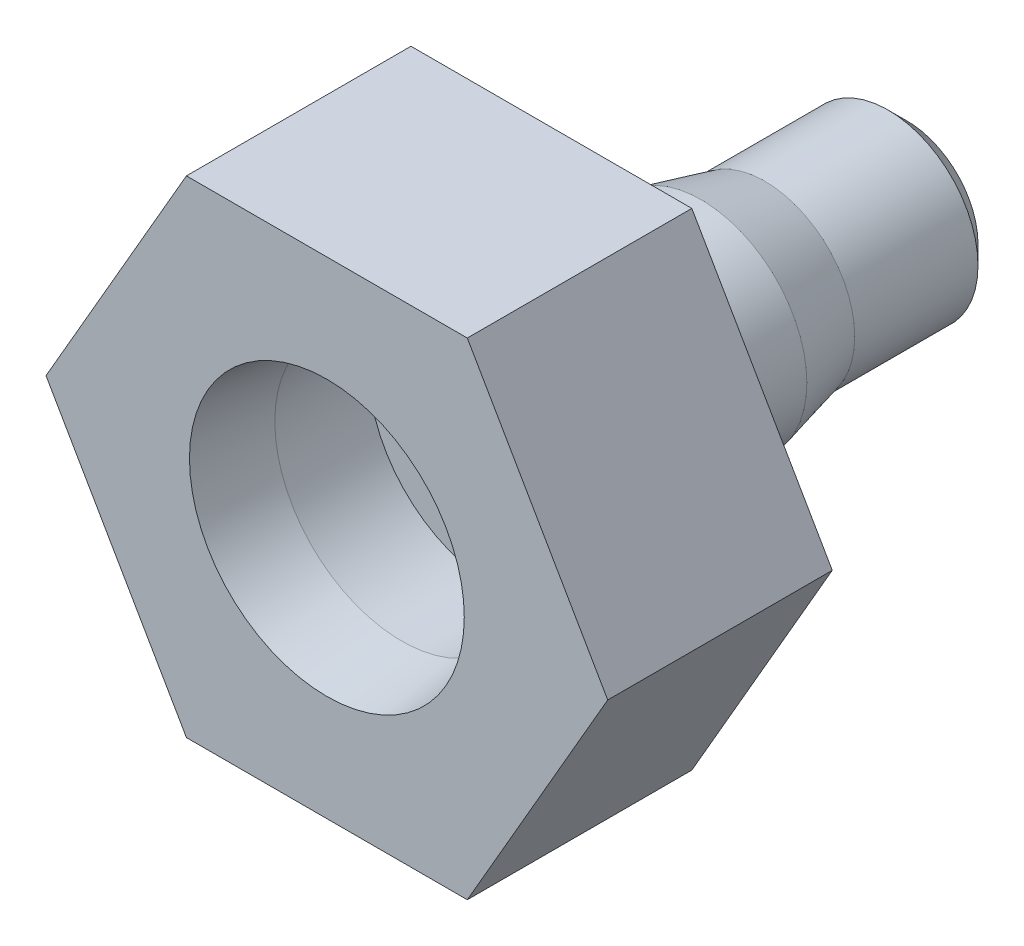
ISO-10303-21;
HEADER;
FILE_DESCRIPTION(('STEP AP214'),'2;1');
FILE_NAME('part.step','',(''),(''),'','','');
FILE_SCHEMA(('AUTOMOTIVE_DESIGN { 1 0 10303 214 1 1 1 1 }'));
ENDSEC;
DATA;
#1=APPLICATION_CONTEXT('core data for automotive mechanical design processes');
#2=APPLICATION_PROTOCOL_DEFINITION('international standard','automotive_design',2000,#1);
#3=PRODUCT_CONTEXT('',#1,'mechanical');
#4=PRODUCT('Part','Part','',(#3));
#5=PRODUCT_RELATED_PRODUCT_CATEGORY('part','',(#4));
#6=PRODUCT_DEFINITION_FORMATION('','',#4);
#7=PRODUCT_DEFINITION_CONTEXT('part definition',#1,'design');
#8=PRODUCT_DEFINITION('design','',#6,#7);
#9=PRODUCT_DEFINITION_SHAPE('','',#8);
#10=(LENGTH_UNIT() NAMED_UNIT(*) SI_UNIT(.MILLI.,.METRE.));
#11=(NAMED_UNIT(*) PLANE_ANGLE_UNIT() SI_UNIT($,.RADIAN.));
#12=(NAMED_UNIT(*) SI_UNIT($,.STERADIAN.) SOLID_ANGLE_UNIT());
#13=UNCERTAINTY_MEASURE_WITH_UNIT(LENGTH_MEASURE(1.E-05),#10,'distance_accuracy_value','');
#14=(GEOMETRIC_REPRESENTATION_CONTEXT(3) GLOBAL_UNCERTAINTY_ASSIGNED_CONTEXT((#13)) GLOBAL_UNIT_ASSIGNED_CONTEXT((#10,
#11,#12)) REPRESENTATION_CONTEXT('',''));
#15=CARTESIAN_POINT('',(0.,0.,0.));
#16=DIRECTION('',(0.,0.,1.));
#17=DIRECTION('',(1.,0.,0.));
#18=AXIS2_PLACEMENT_3D('',#15,#16,#17);
#19=CARTESIAN_POINT('',(0.,0.,-2.40416305603426));
#20=DIRECTION('',(0.,0.,1.));
#21=DIRECTION('',(1.,0.,0.));
#22=AXIS2_PLACEMENT_3D('',#19,#20,#21);
#23=CYLINDRICAL_SURFACE('',#22,0.85);
#24=CARTESIAN_POINT('',(0.,0.,0.));
#25=DIRECTION('',(0.,0.,1.));
#26=DIRECTION('',(1.,0.,0.));
#27=AXIS2_PLACEMENT_3D('',#24,#25,#26);
#28=CIRCLE('',#27,0.85);
#29=CARTESIAN_POINT('',(0.85,0.,0.));
#30=VERTEX_POINT('',#29);
#31=EDGE_CURVE('E146',#30,#30,#28,.F.);
#32=ORIENTED_EDGE('',*,*,#31,.T.);
#33=EDGE_LOOP('',(#32));
#34=FACE_BOUND('',#33,.T.);
#35=CARTESIAN_POINT('',(0.,0.,11.));
#36=DIRECTION('',(0.,0.,1.));
#37=DIRECTION('',(1.,0.,0.));
#38=AXIS2_PLACEMENT_3D('',#35,#36,#37);
#39=CIRCLE('',#38,0.85);
#40=CARTESIAN_POINT('',(0.85,0.,11.));
#41=VERTEX_POINT('',#40);
#42=EDGE_CURVE('E116',#41,#41,#39,.F.);
#43=ORIENTED_EDGE('',*,*,#42,.F.);
#44=EDGE_LOOP('',(#43));
#45=FACE_BOUND('',#44,.T.);
#46=ADVANCED_FACE('F44',(#34,#45),#23,.F.);
#47=CARTESIAN_POINT('',(0.,0.,0.));
#48=DIRECTION('',(0.,0.,1.));
#49=DIRECTION('',(1.,0.,0.));
#50=AXIS2_PLACEMENT_3D('',#47,#48,#49);
#51=PLANE('',#50);
#52=CARTESIAN_POINT('',(0.,0.,0.));
#53=DIRECTION('',(0.,0.,1.));
#54=DIRECTION('',(1.,0.,0.));
#55=AXIS2_PLACEMENT_3D('',#52,#53,#54);
#56=CIRCLE('',#55,1.9);
#57=CARTESIAN_POINT('',(1.9,0.,0.));
#58=VERTEX_POINT('',#57);
#59=EDGE_CURVE('E161',#58,#58,#56,.F.);
#60=ORIENTED_EDGE('',*,*,#59,.T.);
#61=EDGE_LOOP('',(#60));
#62=FACE_BOUND('',#61,.T.);
#63=ORIENTED_EDGE('',*,*,#31,.F.);
#64=EDGE_LOOP('',(#63));
#65=FACE_BOUND('',#64,.T.);
#66=ADVANCED_FACE('F184',(#62,#65),#51,.F.);
#67=CARTESIAN_POINT('',(0.,0.,9.5));
#68=DIRECTION('',(0.,0.,-1.));
#69=DIRECTION('',(-1.,0.,0.));
#70=AXIS2_PLACEMENT_3D('',#67,#68,#69);
#71=CYLINDRICAL_SURFACE('',#70,2.825);
#72=CARTESIAN_POINT('',(0.,0.,5.49865238330795));
#73=DIRECTION('',(0.,0.,1.));
#74=DIRECTION('',(1.,0.,0.));
#75=AXIS2_PLACEMENT_3D('',#72,#73,#74);
#76=CIRCLE('',#75,2.825);
#77=CARTESIAN_POINT('',(2.825,0.,5.49865238330795));
#78=VERTEX_POINT('',#77);
#79=EDGE_CURVE('E158',#78,#78,#76,.T.);
#80=ORIENTED_EDGE('',*,*,#79,.T.);
#81=EDGE_LOOP('',(#80));
#82=FACE_BOUND('',#81,.T.);
#83=CARTESIAN_POINT('',(0.,0.,8.50000000000001));
#84=DIRECTION('',(0.,0.,1.));
#85=DIRECTION('',(1.,0.,0.));
#86=AXIS2_PLACEMENT_3D('',#83,#84,#85);
#87=CIRCLE('',#86,2.825);
#88=CARTESIAN_POINT('',(2.825,0.,8.50000000000001));
#89=VERTEX_POINT('',#88);
#90=EDGE_CURVE('E152',#89,#89,#87,.F.);
#91=ORIENTED_EDGE('',*,*,#90,.T.);
#92=EDGE_LOOP('',(#91));
#93=FACE_BOUND('',#92,.T.);
#94=ADVANCED_FACE('F192',(#82,#93),#71,.T.);
#95=CARTESIAN_POINT('',(0.,0.,9.5));
#96=DIRECTION('',(0.,0.,1.));
#97=DIRECTION('',(1.,0.,0.));
#98=AXIS2_PLACEMENT_3D('',#95,#96,#97);
#99=PLANE('',#98);
#100=CARTESIAN_POINT('',(0.,0.,9.5));
#101=DIRECTION('',(0.,0.,1.));
#102=DIRECTION('',(1.,0.,0.));
#103=AXIS2_PLACEMENT_3D('',#100,#101,#102);
#104=CIRCLE('',#103,3.82500000000001);
#105=CARTESIAN_POINT('',(3.82500000000001,0.,9.5));
#106=VERTEX_POINT('',#105);
#107=EDGE_CURVE('E149',#106,#106,#104,.T.);
#108=ORIENTED_EDGE('',*,*,#107,.T.);
#109=EDGE_LOOP('',(#108));
#110=FACE_BOUND('',#109,.T.);
#111=DIRECTION('',(0.5,0.866025403784439,0.));
#112=VECTOR('',#111,1.);
#113=CARTESIAN_POINT('',(-3.75277674973257,6.5,9.5));
#114=LINE('',#113,#112);
#115=CARTESIAN_POINT('',(-7.50555349946514,0.,9.5));
#116=VERTEX_POINT('',#115);
#117=CARTESIAN_POINT('',(-3.75277674973257,6.5,9.5));
#118=VERTEX_POINT('',#117);
#119=EDGE_CURVE('E78',#116,#118,#114,.T.);
#120=ORIENTED_EDGE('',*,*,#119,.T.);
#121=DIRECTION('',(1.,0.,0.));
#122=VECTOR('',#121,1.);
#123=CARTESIAN_POINT('',(3.75277674973257,6.5,9.5));
#124=LINE('',#123,#122);
#125=CARTESIAN_POINT('',(3.75277674973257,6.5,9.5));
#126=VERTEX_POINT('',#125);
#127=EDGE_CURVE('E83',#118,#126,#124,.T.);
#128=ORIENTED_EDGE('',*,*,#127,.T.);
#129=DIRECTION('',(0.5,-0.866025403784439,0.));
#130=VECTOR('',#129,1.);
#131=CARTESIAN_POINT('',(7.50555349946513,0.,9.5));
#132=LINE('',#131,#130);
#133=CARTESIAN_POINT('',(7.50555349946513,0.,9.5));
#134=VERTEX_POINT('',#133);
#135=EDGE_CURVE('E120',#126,#134,#132,.T.);
#136=ORIENTED_EDGE('',*,*,#135,.T.);
#137=DIRECTION('',(-0.5,-0.866025403784439,0.));
#138=VECTOR('',#137,1.);
#139=CARTESIAN_POINT('',(3.75277674973257,-6.5,9.5));
#140=LINE('',#139,#138);
#141=CARTESIAN_POINT('',(3.75277674973257,-6.5,9.5));
#142=VERTEX_POINT('',#141);
#143=EDGE_CURVE('E62',#134,#142,#140,.T.);
#144=ORIENTED_EDGE('',*,*,#143,.T.);
#145=DIRECTION('',(-1.,0.,0.));
#146=VECTOR('',#145,1.);
#147=CARTESIAN_POINT('',(-3.75277674973257,-6.5,9.5));
#148=LINE('',#147,#146);
#149=CARTESIAN_POINT('',(-3.75277674973257,-6.5,9.5));
#150=VERTEX_POINT('',#149);
#151=EDGE_CURVE('E376',#142,#150,#148,.T.);
#152=ORIENTED_EDGE('',*,*,#151,.T.);
#153=DIRECTION('',(-0.5,0.866025403784439,0.));
#154=VECTOR('',#153,1.);
#155=CARTESIAN_POINT('',(-7.50555349946514,0.,9.5));
#156=LINE('',#155,#154);
#157=EDGE_CURVE('E371',#150,#116,#156,.T.);
#158=ORIENTED_EDGE('',*,*,#157,.T.);
#159=EDGE_LOOP('',(#120,#128,#136,#144,#152,#158));
#160=FACE_BOUND('',#159,.T.);
#161=ADVANCED_FACE('F203',(#110,#160),#99,.F.);
#162=CARTESIAN_POINT('',(0.,0.,9.5));
#163=DIRECTION('',(0.,0.,1.));
#164=DIRECTION('',(1.,0.,0.));
#165=AXIS2_PLACEMENT_3D('',#162,#163,#164);
#166=CONICAL_SURFACE('',#165,3.82500000000001,0.785398163397455);
#167=ORIENTED_EDGE('',*,*,#90,.F.);
#168=EDGE_LOOP('',(#167));
#169=FACE_BOUND('',#168,.T.);
#170=ORIENTED_EDGE('',*,*,#107,.F.);
#171=EDGE_LOOP('',(#170));
#172=FACE_BOUND('',#171,.T.);
#173=ADVANCED_FACE('F201',(#169,#172),#166,.T.);
#174=CARTESIAN_POINT('',(0.,0.,15.5));
#175=DIRECTION('',(0.,0.,1.));
#176=DIRECTION('',(1.,0.,0.));
#177=AXIS2_PLACEMENT_3D('',#174,#175,#176);
#178=PLANE('',#177);
#179=CARTESIAN_POINT('',(0.,0.,15.5));
#180=DIRECTION('',(0.,0.,1.));
#181=DIRECTION('',(1.,0.,0.));
#182=AXIS2_PLACEMENT_3D('',#179,#180,#181);
#183=CIRCLE('',#182,3.67198166940478);
#184=CARTESIAN_POINT('',(3.67198166940478,0.,15.5));
#185=VERTEX_POINT('',#184);
#186=EDGE_CURVE('E13',#185,#185,#183,.F.);
#187=ORIENTED_EDGE('',*,*,#186,.T.);
#188=EDGE_LOOP('',(#187));
#189=FACE_BOUND('',#188,.T.);
#190=DIRECTION('',(0.5,0.866025403784439,0.));
#191=VECTOR('',#190,1.);
#192=CARTESIAN_POINT('',(3.75277674973257,-6.5,15.5));
#193=LINE('',#192,#191);
#194=CARTESIAN_POINT('',(3.75277674973257,-6.5,15.5));
#195=VERTEX_POINT('',#194);
#196=CARTESIAN_POINT('',(7.50555349946513,0.,15.5));
#197=VERTEX_POINT('',#196);
#198=EDGE_CURVE('E95',#195,#197,#193,.T.);
#199=ORIENTED_EDGE('',*,*,#198,.T.);
#200=DIRECTION('',(-0.5,0.866025403784438,0.));
#201=VECTOR('',#200,1.);
#202=CARTESIAN_POINT('',(7.50555349946513,0.,15.5));
#203=LINE('',#202,#201);
#204=CARTESIAN_POINT('',(3.75277674973257,6.5,15.5));
#205=VERTEX_POINT('',#204);
#206=EDGE_CURVE('E109',#197,#205,#203,.T.);
#207=ORIENTED_EDGE('',*,*,#206,.T.);
#208=DIRECTION('',(-1.,0.,0.));
#209=VECTOR('',#208,1.);
#210=CARTESIAN_POINT('',(3.75277674973257,6.5,15.5));
#211=LINE('',#210,#209);
#212=CARTESIAN_POINT('',(-3.75277674973257,6.5,15.5));
#213=VERTEX_POINT('',#212);
#214=EDGE_CURVE('E113',#205,#213,#211,.T.);
#215=ORIENTED_EDGE('',*,*,#214,.T.);
#216=DIRECTION('',(-0.499999999999999,-0.866025403784439,0.));
#217=VECTOR('',#216,1.);
#218=CARTESIAN_POINT('',(-3.75277674973257,6.5,15.5));
#219=LINE('',#218,#217);
#220=CARTESIAN_POINT('',(-7.50555349946514,0.,15.5));
#221=VERTEX_POINT('',#220);
#222=EDGE_CURVE('E125',#213,#221,#219,.T.);
#223=ORIENTED_EDGE('',*,*,#222,.T.);
#224=DIRECTION('',(0.5,-0.866025403784438,0.));
#225=VECTOR('',#224,1.);
#226=CARTESIAN_POINT('',(-7.50555349946514,0.,15.5));
#227=LINE('',#226,#225);
#228=CARTESIAN_POINT('',(-3.75277674973257,-6.5,15.5));
#229=VERTEX_POINT('',#228);
#230=EDGE_CURVE('E127',#221,#229,#227,.T.);
#231=ORIENTED_EDGE('',*,*,#230,.T.);
#232=DIRECTION('',(1.,0.,0.));
#233=VECTOR('',#232,1.);
#234=CARTESIAN_POINT('',(-3.75277674973257,-6.5,15.5));
#235=LINE('',#234,#233);
#236=EDGE_CURVE('E132',#229,#195,#235,.T.);
#237=ORIENTED_EDGE('',*,*,#236,.T.);
#238=EDGE_LOOP('',(#199,#207,#215,#223,#231,#237));
#239=FACE_BOUND('',#238,.T.);
#240=ADVANCED_FACE('F111',(#189,#239),#178,.T.);
#241=CARTESIAN_POINT('',(3.75277674973257,6.5,-10.3578280114753));
#242=DIRECTION('',(0.,1.,0.));
#243=DIRECTION('',(0.,0.,1.));
#244=AXIS2_PLACEMENT_3D('',#241,#242,#243);
#245=PLANE('',#244);
#246=ORIENTED_EDGE('',*,*,#127,.F.);
#247=DIRECTION('',(0.,0.,1.));
#248=VECTOR('',#247,1.);
#249=CARTESIAN_POINT('',(-3.75277674973257,6.5,-10.3578280114753));
#250=LINE('',#249,#248);
#251=EDGE_CURVE('E121',#118,#213,#250,.T.);
#252=ORIENTED_EDGE('',*,*,#251,.T.);
#253=ORIENTED_EDGE('',*,*,#214,.F.);
#254=DIRECTION('',(0.,0.,1.));
#255=VECTOR('',#254,1.);
#256=CARTESIAN_POINT('',(3.75277674973257,6.5,-10.3578280114753));
#257=LINE('',#256,#255);
#258=EDGE_CURVE('E118',#126,#205,#257,.T.);
#259=ORIENTED_EDGE('',*,*,#258,.F.);
#260=EDGE_LOOP('',(#246,#252,#253,#259));
#261=FACE_BOUND('',#260,.T.);
#262=ADVANCED_FACE('F123',(#261),#245,.T.);
#263=CARTESIAN_POINT('',(-3.75277674973257,6.5,-10.3578280114753));
#264=DIRECTION('',(-0.866025403784439,0.5,0.));
#265=DIRECTION('',(-0.5,-0.866025403784439,0.));
#266=AXIS2_PLACEMENT_3D('',#263,#264,#265);
#267=PLANE('',#266);
#268=ORIENTED_EDGE('',*,*,#119,.F.);
#269=DIRECTION('',(0.,0.,1.));
#270=VECTOR('',#269,1.);
#271=CARTESIAN_POINT('',(-7.50555349946514,0.,-10.3578280114753));
#272=LINE('',#271,#270);
#273=EDGE_CURVE('E143',#116,#221,#272,.T.);
#274=ORIENTED_EDGE('',*,*,#273,.T.);
#275=ORIENTED_EDGE('',*,*,#222,.F.);
#276=ORIENTED_EDGE('',*,*,#251,.F.);
#277=EDGE_LOOP('',(#268,#274,#275,#276));
#278=FACE_BOUND('',#277,.T.);
#279=ADVANCED_FACE('F257',(#278),#267,.T.);
#280=CARTESIAN_POINT('',(-7.50555349946514,0.,-10.3578280114753));
#281=DIRECTION('',(-0.866025403784439,-0.5,0.));
#282=DIRECTION('',(0.5,-0.866025403784439,0.));
#283=AXIS2_PLACEMENT_3D('',#280,#281,#282);
#284=PLANE('',#283);
#285=ORIENTED_EDGE('',*,*,#157,.F.);
#286=DIRECTION('',(0.,0.,1.));
#287=VECTOR('',#286,1.);
#288=CARTESIAN_POINT('',(-3.75277674973257,-6.5,-10.3578280114753));
#289=LINE('',#288,#287);
#290=EDGE_CURVE('E140',#150,#229,#289,.T.);
#291=ORIENTED_EDGE('',*,*,#290,.T.);
#292=ORIENTED_EDGE('',*,*,#230,.F.);
#293=ORIENTED_EDGE('',*,*,#273,.F.);
#294=EDGE_LOOP('',(#285,#291,#292,#293));
#295=FACE_BOUND('',#294,.T.);
#296=ADVANCED_FACE('F253',(#295),#284,.T.);
#297=CARTESIAN_POINT('',(-3.75277674973257,-6.5,-10.3578280114753));
#298=DIRECTION('',(0.,-1.,0.));
#299=DIRECTION('',(1.,0.,0.));
#300=AXIS2_PLACEMENT_3D('',#297,#298,#299);
#301=PLANE('',#300);
#302=ORIENTED_EDGE('',*,*,#151,.F.);
#303=DIRECTION('',(0.,0.,1.));
#304=VECTOR('',#303,1.);
#305=CARTESIAN_POINT('',(3.75277674973257,-6.5,-10.3578280114753));
#306=LINE('',#305,#304);
#307=EDGE_CURVE('E137',#142,#195,#306,.T.);
#308=ORIENTED_EDGE('',*,*,#307,.T.);
#309=ORIENTED_EDGE('',*,*,#236,.F.);
#310=ORIENTED_EDGE('',*,*,#290,.F.);
#311=EDGE_LOOP('',(#302,#308,#309,#310));
#312=FACE_BOUND('',#311,.T.);
#313=ADVANCED_FACE('F250',(#312),#301,.T.);
#314=CARTESIAN_POINT('',(3.75277674973257,-6.5,-10.3578280114753));
#315=DIRECTION('',(0.866025403784439,-0.5,0.));
#316=DIRECTION('',(0.5,0.866025403784439,0.));
#317=AXIS2_PLACEMENT_3D('',#314,#315,#316);
#318=PLANE('',#317);
#319=ORIENTED_EDGE('',*,*,#143,.F.);
#320=DIRECTION('',(0.,0.,1.));
#321=VECTOR('',#320,1.);
#322=CARTESIAN_POINT('',(7.50555349946513,0.,-10.3578280114753));
#323=LINE('',#322,#321);
#324=EDGE_CURVE('E135',#134,#197,#323,.T.);
#325=ORIENTED_EDGE('',*,*,#324,.T.);
#326=ORIENTED_EDGE('',*,*,#198,.F.);
#327=ORIENTED_EDGE('',*,*,#307,.F.);
#328=EDGE_LOOP('',(#319,#325,#326,#327));
#329=FACE_BOUND('',#328,.T.);
#330=ADVANCED_FACE('F246',(#329),#318,.T.);
#331=CARTESIAN_POINT('',(7.50555349946513,0.,-10.3578280114753));
#332=DIRECTION('',(0.866025403784439,0.5,0.));
#333=DIRECTION('',(-0.5,0.866025403784439,0.));
#334=AXIS2_PLACEMENT_3D('',#331,#332,#333);
#335=PLANE('',#334);
#336=ORIENTED_EDGE('',*,*,#324,.F.);
#337=ORIENTED_EDGE('',*,*,#135,.F.);
#338=ORIENTED_EDGE('',*,*,#258,.T.);
#339=ORIENTED_EDGE('',*,*,#206,.F.);
#340=EDGE_LOOP('',(#336,#337,#338,#339));
#341=FACE_BOUND('',#340,.T.);
#342=ADVANCED_FACE('F119',(#341),#335,.T.);
#343=CARTESIAN_POINT('',(0.,0.,17.490306627408));
#344=DIRECTION('',(0.,0.,-1.));
#345=DIRECTION('',(-1.,0.,0.));
#346=AXIS2_PLACEMENT_3D('',#343,#344,#345);
#347=CYLINDRICAL_SURFACE('',#346,2.4);
#348=CARTESIAN_POINT('',(0.,0.,0.500000000000004));
#349=DIRECTION('',(0.,0.,1.));
#350=DIRECTION('',(1.,0.,0.));
#351=AXIS2_PLACEMENT_3D('',#348,#349,#350);
#352=CIRCLE('',#351,2.4);
#353=CARTESIAN_POINT('',(2.4,0.,0.500000000000004));
#354=VERTEX_POINT('',#353);
#355=EDGE_CURVE('E164',#354,#354,#352,.T.);
#356=ORIENTED_EDGE('',*,*,#355,.T.);
#357=EDGE_LOOP('',(#356));
#358=FACE_BOUND('',#357,.T.);
#359=CARTESIAN_POINT('',(0.,0.,3.79407048655519));
#360=DIRECTION('',(0.,0.,1.));
#361=DIRECTION('',(1.,0.,0.));
#362=AXIS2_PLACEMENT_3D('',#359,#360,#361);
#363=CIRCLE('',#362,2.4);
#364=CARTESIAN_POINT('',(2.4,0.,3.79407048655519));
#365=VERTEX_POINT('',#364);
#366=EDGE_CURVE('E155',#365,#365,#363,.F.);
#367=ORIENTED_EDGE('',*,*,#366,.T.);
#368=EDGE_LOOP('',(#367));
#369=FACE_BOUND('',#368,.T.);
#370=ADVANCED_FACE('F223',(#358,#369),#347,.T.);
#371=CARTESIAN_POINT('',(0.,0.,3.79407048655519));
#372=DIRECTION('',(0.,0.,1.));
#373=DIRECTION('',(1.,0.,0.));
#374=AXIS2_PLACEMENT_3D('',#371,#372,#373);
#375=CONICAL_SURFACE('',#374,2.4,0.244346095279203);
#376=ORIENTED_EDGE('',*,*,#79,.F.);
#377=EDGE_LOOP('',(#376));
#378=FACE_BOUND('',#377,.T.);
#379=ORIENTED_EDGE('',*,*,#366,.F.);
#380=EDGE_LOOP('',(#379));
#381=FACE_BOUND('',#380,.T.);
#382=ADVANCED_FACE('F217',(#378,#381),#375,.T.);
#383=CARTESIAN_POINT('',(0.,0.,0.));
#384=DIRECTION('',(0.,0.,1.));
#385=DIRECTION('',(1.,0.,0.));
#386=AXIS2_PLACEMENT_3D('',#383,#384,#385);
#387=CONICAL_SURFACE('',#386,1.9,0.785398163397449);
#388=ORIENTED_EDGE('',*,*,#355,.F.);
#389=EDGE_LOOP('',(#388));
#390=FACE_BOUND('',#389,.T.);
#391=ORIENTED_EDGE('',*,*,#59,.F.);
#392=EDGE_LOOP('',(#391));
#393=FACE_BOUND('',#392,.T.);
#394=ADVANCED_FACE('F222',(#390,#393),#387,.T.);
#395=CARTESIAN_POINT('',(0.,0.,11.));
#396=DIRECTION('',(0.,0.,1.));
#397=DIRECTION('',(1.,0.,0.));
#398=AXIS2_PLACEMENT_3D('',#395,#396,#397);
#399=PLANE('',#398);
#400=CARTESIAN_POINT('',(0.,0.,11.));
#401=DIRECTION('',(0.,0.,1.));
#402=DIRECTION('',(1.,0.,0.));
#403=AXIS2_PLACEMENT_3D('',#400,#401,#402);
#404=CIRCLE('',#403,3.3909);
#405=CARTESIAN_POINT('',(3.3909,0.,11.));
#406=VERTEX_POINT('',#405);
#407=EDGE_CURVE('E168',#406,#406,#404,.T.);
#408=ORIENTED_EDGE('',*,*,#407,.T.);
#409=EDGE_LOOP('',(#408));
#410=FACE_BOUND('',#409,.T.);
#411=ORIENTED_EDGE('',*,*,#42,.T.);
#412=EDGE_LOOP('',(#411));
#413=FACE_BOUND('',#412,.T.);
#414=ADVANCED_FACE('F180',(#410,#413),#399,.T.);
#415=CARTESIAN_POINT('',(0.,0.,11.));
#416=DIRECTION('',(0.,0.,1.));
#417=DIRECTION('',(1.,0.,0.));
#418=AXIS2_PLACEMENT_3D('',#415,#416,#417);
#419=CYLINDRICAL_SURFACE('',#418,3.3909);
#420=CARTESIAN_POINT('',(0.,0.,13.5));
#421=DIRECTION('',(0.,0.,1.));
#422=DIRECTION('',(1.,0.,0.));
#423=AXIS2_PLACEMENT_3D('',#420,#421,#422);
#424=CIRCLE('',#423,3.3909);
#425=CARTESIAN_POINT('',(3.3909,0.,13.5));
#426=VERTEX_POINT('',#425);
#427=EDGE_CURVE('E54',#426,#426,#424,.T.);
#428=ORIENTED_EDGE('',*,*,#427,.T.);
#429=EDGE_LOOP('',(#428));
#430=FACE_BOUND('',#429,.T.);
#431=ORIENTED_EDGE('',*,*,#407,.F.);
#432=EDGE_LOOP('',(#431));
#433=FACE_BOUND('',#432,.T.);
#434=ADVANCED_FACE('F172',(#430,#433),#419,.F.);
#435=CARTESIAN_POINT('',(0.,0.,13.5));
#436=DIRECTION('',(0.,0.,1.));
#437=DIRECTION('',(1.,0.,0.));
#438=AXIS2_PLACEMENT_3D('',#435,#436,#437);
#439=CONICAL_SURFACE('',#438,3.3909,0.139626340159544);
#440=ORIENTED_EDGE('',*,*,#186,.F.);
#441=EDGE_LOOP('',(#440));
#442=FACE_BOUND('',#441,.T.);
#443=ORIENTED_EDGE('',*,*,#427,.F.);
#444=EDGE_LOOP('',(#443));
#445=FACE_BOUND('',#444,.T.);
#446=ADVANCED_FACE('F47',(#442,#445),#439,.F.);
#447=CLOSED_SHELL('',(#46,#66,#94,#161,#173,#240,#262,#279,#296,#313,#330,#342,#370,#382,#394,
#414,#434,#446));
#448=MANIFOLD_SOLID_BREP('B2',#447);
#449=ADVANCED_BREP_SHAPE_REPRESENTATION('',(#18,#448),#14);
#450=SHAPE_DEFINITION_REPRESENTATION(#9,#449);
ENDSEC;
END-ISO-10303-21;
